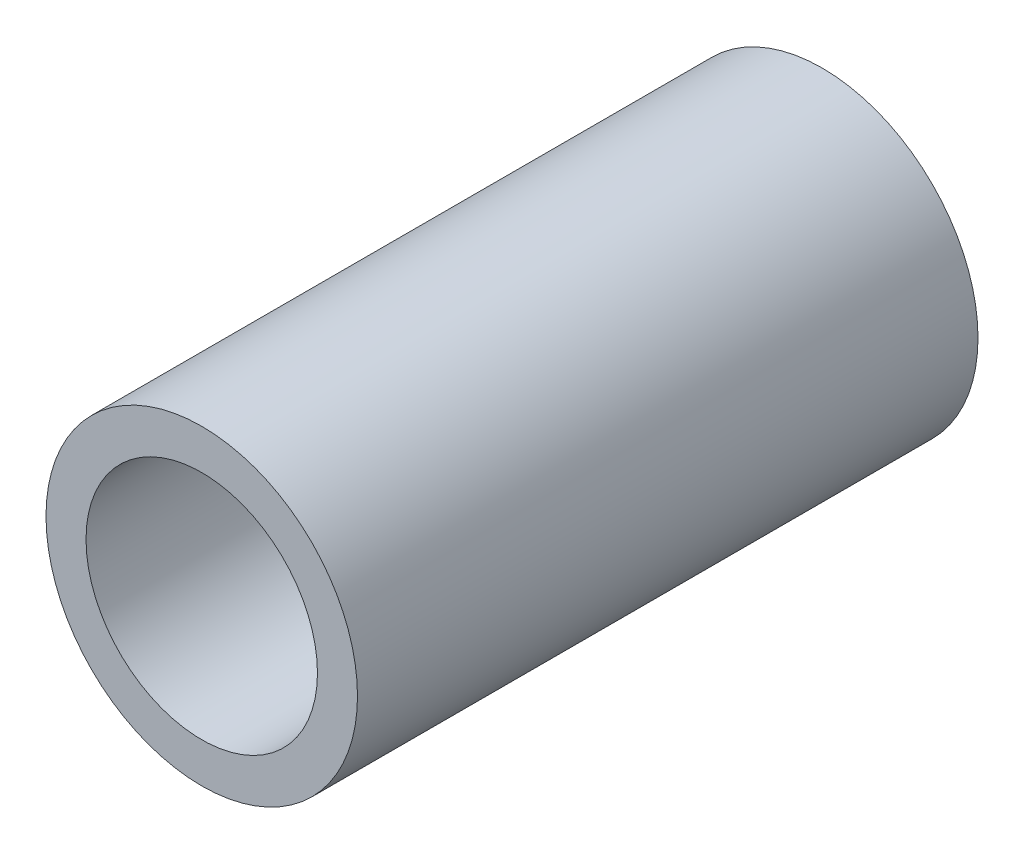
ISO-10303-21;
HEADER;
FILE_DESCRIPTION(('STEP AP214'),'2;1');
FILE_NAME('part.step','',(''),(''),'','','');
FILE_SCHEMA(('AUTOMOTIVE_DESIGN { 1 0 10303 214 1 1 1 1 }'));
ENDSEC;
DATA;
#1=APPLICATION_CONTEXT('core data for automotive mechanical design processes');
#2=APPLICATION_PROTOCOL_DEFINITION('international standard','automotive_design',2000,#1);
#3=PRODUCT_CONTEXT('',#1,'mechanical');
#4=PRODUCT('Part','Part','',(#3));
#5=PRODUCT_RELATED_PRODUCT_CATEGORY('part','',(#4));
#6=PRODUCT_DEFINITION_FORMATION('','',#4);
#7=PRODUCT_DEFINITION_CONTEXT('part definition',#1,'design');
#8=PRODUCT_DEFINITION('design','',#6,#7);
#9=PRODUCT_DEFINITION_SHAPE('','',#8);
#10=(LENGTH_UNIT() NAMED_UNIT(*) SI_UNIT(.MILLI.,.METRE.));
#11=(NAMED_UNIT(*) PLANE_ANGLE_UNIT() SI_UNIT($,.RADIAN.));
#12=(NAMED_UNIT(*) SI_UNIT($,.STERADIAN.) SOLID_ANGLE_UNIT());
#13=UNCERTAINTY_MEASURE_WITH_UNIT(LENGTH_MEASURE(1.E-05),#10,'distance_accuracy_value','');
#14=(GEOMETRIC_REPRESENTATION_CONTEXT(3) GLOBAL_UNCERTAINTY_ASSIGNED_CONTEXT((#13)) GLOBAL_UNIT_ASSIGNED_CONTEXT((#10,
#11,#12)) REPRESENTATION_CONTEXT('',''));
#15=CARTESIAN_POINT('',(0.,0.,0.));
#16=DIRECTION('',(0.,0.,1.));
#17=DIRECTION('',(1.,0.,0.));
#18=AXIS2_PLACEMENT_3D('',#15,#16,#17);
#19=CARTESIAN_POINT('',(0.,0.,6.35));
#20=DIRECTION('',(0.,0.,1.));
#21=DIRECTION('',(1.,0.,0.));
#22=AXIS2_PLACEMENT_3D('',#19,#20,#21);
#23=PLANE('',#22);
#24=CARTESIAN_POINT('',(0.,0.,6.35));
#25=DIRECTION('',(0.,0.,1.));
#26=DIRECTION('',(1.,0.,0.));
#27=AXIS2_PLACEMENT_3D('',#24,#25,#26);
#28=CIRCLE('',#27,3.1877);
#29=CARTESIAN_POINT('',(3.1877,0.,6.35));
#30=VERTEX_POINT('',#29);
#31=EDGE_CURVE('E10',#30,#30,#28,.T.);
#32=ORIENTED_EDGE('',*,*,#31,.T.);
#33=EDGE_LOOP('',(#32));
#34=FACE_BOUND('',#33,.T.);
#35=CARTESIAN_POINT('',(0.,0.,6.35));
#36=DIRECTION('',(0.,0.,1.));
#37=DIRECTION('',(1.,0.,0.));
#38=AXIS2_PLACEMENT_3D('',#35,#36,#37);
#39=CIRCLE('',#38,2.36855);
#40=CARTESIAN_POINT('',(2.36855,0.,6.35));
#41=VERTEX_POINT('',#40);
#42=EDGE_CURVE('E43',#41,#41,#39,.T.);
#43=ORIENTED_EDGE('',*,*,#42,.F.);
#44=EDGE_LOOP('',(#43));
#45=FACE_BOUND('',#44,.T.);
#46=ADVANCED_FACE('F32',(#34,#45),#23,.T.);
#47=CARTESIAN_POINT('',(0.,0.,-6.35));
#48=DIRECTION('',(0.,0.,1.));
#49=DIRECTION('',(1.,0.,0.));
#50=AXIS2_PLACEMENT_3D('',#47,#48,#49);
#51=PLANE('',#50);
#52=CARTESIAN_POINT('',(0.,0.,-6.35));
#53=DIRECTION('',(0.,0.,1.));
#54=DIRECTION('',(1.,0.,0.));
#55=AXIS2_PLACEMENT_3D('',#52,#53,#54);
#56=CIRCLE('',#55,3.1877);
#57=CARTESIAN_POINT('',(3.1877,0.,-6.35));
#58=VERTEX_POINT('',#57);
#59=EDGE_CURVE('E36',#58,#58,#56,.T.);
#60=ORIENTED_EDGE('',*,*,#59,.F.);
#61=EDGE_LOOP('',(#60));
#62=FACE_BOUND('',#61,.T.);
#63=CARTESIAN_POINT('',(0.,0.,-6.35));
#64=DIRECTION('',(0.,0.,1.));
#65=DIRECTION('',(1.,0.,0.));
#66=AXIS2_PLACEMENT_3D('',#63,#64,#65);
#67=CIRCLE('',#66,2.36855);
#68=CARTESIAN_POINT('',(2.36855,0.,-6.35));
#69=VERTEX_POINT('',#68);
#70=EDGE_CURVE('E45',#69,#69,#67,.T.);
#71=ORIENTED_EDGE('',*,*,#70,.T.);
#72=EDGE_LOOP('',(#71));
#73=FACE_BOUND('',#72,.T.);
#74=ADVANCED_FACE('F55',(#62,#73),#51,.F.);
#75=CARTESIAN_POINT('',(0.,0.,6.35));
#76=DIRECTION('',(0.,0.,-1.));
#77=DIRECTION('',(-1.,0.,0.));
#78=AXIS2_PLACEMENT_3D('',#75,#76,#77);
#79=CYLINDRICAL_SURFACE('',#78,3.1877);
#80=ORIENTED_EDGE('',*,*,#31,.F.);
#81=EDGE_LOOP('',(#80));
#82=FACE_BOUND('',#81,.T.);
#83=ORIENTED_EDGE('',*,*,#59,.T.);
#84=EDGE_LOOP('',(#83));
#85=FACE_BOUND('',#84,.T.);
#86=ADVANCED_FACE('F34',(#82,#85),#79,.T.);
#87=CARTESIAN_POINT('',(0.,0.,6.35));
#88=DIRECTION('',(0.,0.,-1.));
#89=DIRECTION('',(-1.,0.,0.));
#90=AXIS2_PLACEMENT_3D('',#87,#88,#89);
#91=CYLINDRICAL_SURFACE('',#90,2.36855);
#92=ORIENTED_EDGE('',*,*,#42,.T.);
#93=EDGE_LOOP('',(#92));
#94=FACE_BOUND('',#93,.T.);
#95=ORIENTED_EDGE('',*,*,#70,.F.);
#96=EDGE_LOOP('',(#95));
#97=FACE_BOUND('',#96,.T.);
#98=ADVANCED_FACE('F51',(#94,#97),#91,.F.);
#99=CLOSED_SHELL('',(#46,#74,#86,#98));
#100=MANIFOLD_SOLID_BREP('B2',#99);
#101=ADVANCED_BREP_SHAPE_REPRESENTATION('',(#18,#100),#14);
#102=SHAPE_DEFINITION_REPRESENTATION(#9,#101);
ENDSEC;
END-ISO-10303-21;
